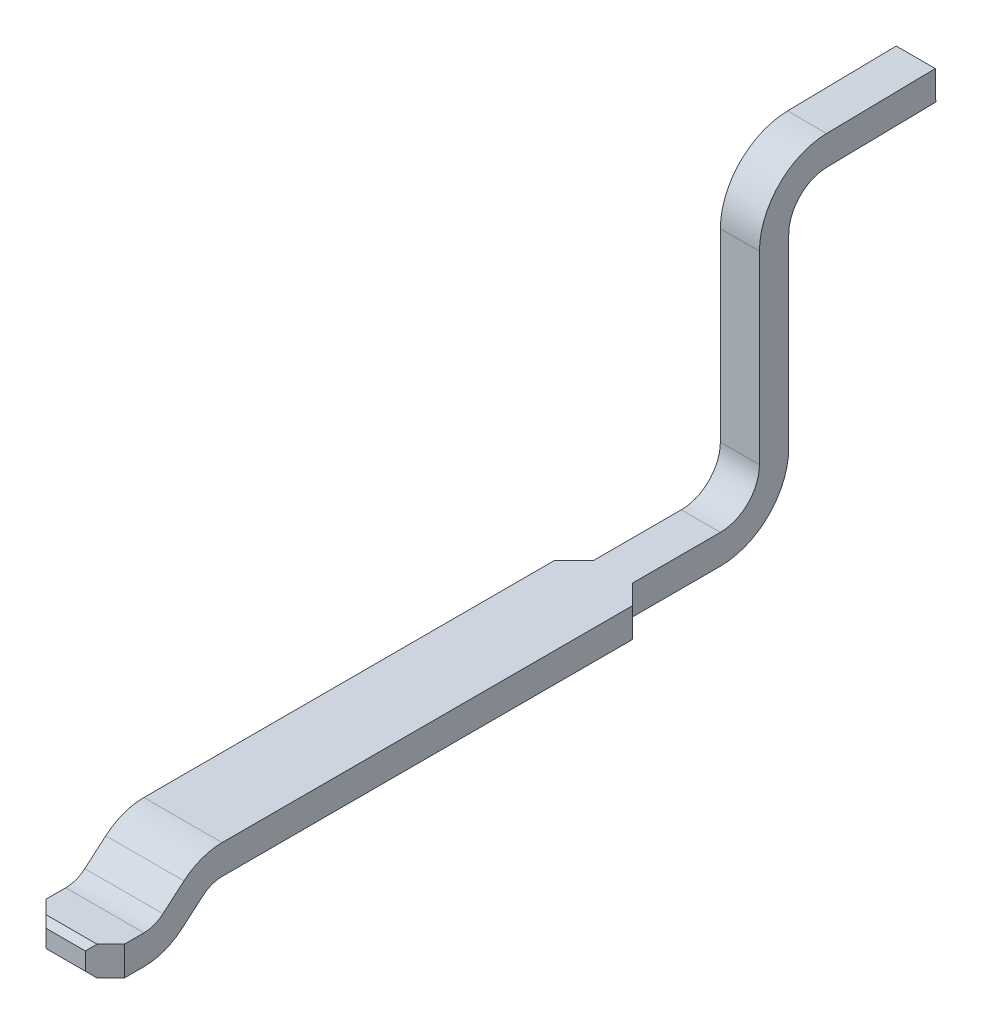
ISO-10303-21;
HEADER;
FILE_DESCRIPTION(('STEP AP214'),'2;1');
FILE_NAME('part.step','',(''),(''),'','','');
FILE_SCHEMA(('AUTOMOTIVE_DESIGN { 1 0 10303 214 1 1 1 1 }'));
ENDSEC;
DATA;
#1=APPLICATION_CONTEXT('core data for automotive mechanical design processes');
#2=APPLICATION_PROTOCOL_DEFINITION('international standard','automotive_design',2000,#1);
#3=PRODUCT_CONTEXT('',#1,'mechanical');
#4=PRODUCT('Part','Part','',(#3));
#5=PRODUCT_RELATED_PRODUCT_CATEGORY('part','',(#4));
#6=PRODUCT_DEFINITION_FORMATION('','',#4);
#7=PRODUCT_DEFINITION_CONTEXT('part definition',#1,'design');
#8=PRODUCT_DEFINITION('design','',#6,#7);
#9=PRODUCT_DEFINITION_SHAPE('','',#8);
#10=(LENGTH_UNIT() NAMED_UNIT(*) SI_UNIT(.MILLI.,.METRE.));
#11=(NAMED_UNIT(*) PLANE_ANGLE_UNIT() SI_UNIT($,.RADIAN.));
#12=(NAMED_UNIT(*) SI_UNIT($,.STERADIAN.) SOLID_ANGLE_UNIT());
#13=UNCERTAINTY_MEASURE_WITH_UNIT(LENGTH_MEASURE(1.E-05),#10,'distance_accuracy_value','');
#14=(GEOMETRIC_REPRESENTATION_CONTEXT(3) GLOBAL_UNCERTAINTY_ASSIGNED_CONTEXT((#13)) GLOBAL_UNIT_ASSIGNED_CONTEXT((#10,
#11,#12)) REPRESENTATION_CONTEXT('',''));
#15=CARTESIAN_POINT('',(0.,0.,0.));
#16=DIRECTION('',(0.,0.,1.));
#17=DIRECTION('',(1.,0.,0.));
#18=AXIS2_PLACEMENT_3D('',#15,#16,#17);
#19=CARTESIAN_POINT('',(1.20403496496787,8.074228109921,4.324047830079));
#20=DIRECTION('',(0.,0.707106781186548,0.707106781186548));
#21=DIRECTION('',(0.,-0.707106781186548,0.707106781186548));
#22=AXIS2_PLACEMENT_3D('',#19,#20,#21);
#23=PLANE('',#22);
#24=DIRECTION('',(-0.577350269189631,0.577350269189615,-0.577350269189631));
#25=VECTOR('',#24,1.);
#26=CARTESIAN_POINT('',(1.23973309999987,8.04019892,4.35807702));
#27=LINE('',#26,#25);
#28=CARTESIAN_POINT('',(1.23973309999987,8.04019892,4.35807702));
#29=VERTEX_POINT('',#28);
#30=CARTESIAN_POINT('',(1.20973309999987,8.07019892,4.32807702));
#31=VERTEX_POINT('',#30);
#32=EDGE_CURVE('E279',#29,#31,#27,.T.);
#33=ORIENTED_EDGE('',*,*,#32,.F.);
#34=DIRECTION('',(-1.,0.,0.));
#35=VECTOR('',#34,1.);
#36=CARTESIAN_POINT('',(1.44543123503187,8.04019892,4.35807702));
#37=LINE('',#36,#35);
#38=CARTESIAN_POINT('',(1.43973309999987,8.04019892,4.35807702));
#39=VERTEX_POINT('',#38);
#40=EDGE_CURVE('E356',#29,#39,#37,.F.);
#41=ORIENTED_EDGE('',*,*,#40,.T.);
#42=DIRECTION('',(-0.577350269189631,-0.577350269189606,0.57735026918964));
#43=VECTOR('',#42,1.);
#44=CARTESIAN_POINT('',(1.46973309999987,8.07019892,4.32807702));
#45=LINE('',#44,#43);
#46=CARTESIAN_POINT('',(1.46973309999987,8.07019892,4.32807702));
#47=VERTEX_POINT('',#46);
#48=EDGE_CURVE('E269',#47,#39,#45,.T.);
#49=ORIENTED_EDGE('',*,*,#48,.F.);
#50=DIRECTION('',(1.,0.,0.));
#51=VECTOR('',#50,1.);
#52=CARTESIAN_POINT('',(1.54773309999987,8.07019892,4.32807702));
#53=LINE('',#52,#51);
#54=EDGE_CURVE('E276',#31,#47,#53,.T.);
#55=ORIENTED_EDGE('',*,*,#54,.F.);
#56=EDGE_LOOP('',(#33,#41,#49,#55));
#57=FACE_BOUND('',#56,.T.);
#58=ADVANCED_FACE('F17',(#57),#23,.T.);
#59=CARTESIAN_POINT('',(1.44543123503187,7.944500784968,4.35807702));
#60=DIRECTION('',(0.,0.,-1.));
#61=DIRECTION('',(-1.,0.,0.));
#62=AXIS2_PLACEMENT_3D('',#59,#60,#61);
#63=PLANE('',#62);
#64=DIRECTION('',(0.,1.,0.));
#65=VECTOR('',#64,1.);
#66=CARTESIAN_POINT('',(1.43973309999987,7.914500784968,4.35807702));
#67=LINE('',#66,#65);
#68=CARTESIAN_POINT('',(1.43973309999987,7.95019892,4.35807702));
#69=VERTEX_POINT('',#68);
#70=EDGE_CURVE('E256',#39,#69,#67,.F.);
#71=ORIENTED_EDGE('',*,*,#70,.F.);
#72=ORIENTED_EDGE('',*,*,#40,.F.);
#73=DIRECTION('',(0.,1.,0.));
#74=VECTOR('',#73,1.);
#75=CARTESIAN_POINT('',(1.23973309999987,7.914500784968,4.35807702));
#76=LINE('',#75,#74);
#77=CARTESIAN_POINT('',(1.23973309999987,7.95019892,4.35807702));
#78=VERTEX_POINT('',#77);
#79=EDGE_CURVE('E338',#78,#29,#76,.T.);
#80=ORIENTED_EDGE('',*,*,#79,.F.);
#81=DIRECTION('',(1.,0.,0.));
#82=VECTOR('',#81,1.);
#83=CARTESIAN_POINT('',(1.47543123503187,7.95019892,4.35807702));
#84=LINE('',#83,#82);
#85=EDGE_CURVE('E331',#69,#78,#84,.F.);
#86=ORIENTED_EDGE('',*,*,#85,.F.);
#87=EDGE_LOOP('',(#71,#72,#80,#86));
#88=FACE_BOUND('',#87,.T.);
#89=ADVANCED_FACE('F775',(#88),#63,.F.);
#90=CARTESIAN_POINT('',(1.47543123503187,7.916169730079,4.324047830079));
#91=DIRECTION('',(0.,-0.707106781186548,0.707106781186548));
#92=DIRECTION('',(0.,-0.707106781186548,-0.707106781186548));
#93=AXIS2_PLACEMENT_3D('',#90,#91,#92);
#94=PLANE('',#93);
#95=DIRECTION('',(0.57735026918962,-0.577350269189629,-0.577350269189629));
#96=VECTOR('',#95,1.);
#97=CARTESIAN_POINT('',(1.43973309999987,7.95019892,4.35807702));
#98=LINE('',#97,#96);
#99=CARTESIAN_POINT('',(1.46973309999987,7.92019892,4.32807702));
#100=VERTEX_POINT('',#99);
#101=EDGE_CURVE('E270',#69,#100,#98,.T.);
#102=ORIENTED_EDGE('',*,*,#101,.F.);
#103=ORIENTED_EDGE('',*,*,#85,.T.);
#104=DIRECTION('',(0.57735026918962,0.577350269189637,0.57735026918962));
#105=VECTOR('',#104,1.);
#106=CARTESIAN_POINT('',(1.20973309999987,7.92019892,4.32807702));
#107=LINE('',#106,#105);
#108=CARTESIAN_POINT('',(1.20973309999987,7.92019892,4.32807702));
#109=VERTEX_POINT('',#108);
#110=EDGE_CURVE('E309',#109,#78,#107,.T.);
#111=ORIENTED_EDGE('',*,*,#110,.F.);
#112=DIRECTION('',(1.,0.,0.));
#113=VECTOR('',#112,1.);
#114=CARTESIAN_POINT('',(1.54773309999987,7.92019892,4.32807702));
#115=LINE('',#114,#113);
#116=EDGE_CURVE('E252',#109,#100,#115,.T.);
#117=ORIENTED_EDGE('',*,*,#116,.T.);
#118=EDGE_LOOP('',(#102,#103,#111,#117));
#119=FACE_BOUND('',#118,.T.);
#120=ADVANCED_FACE('F768',(#119),#94,.T.);
#121=CARTESIAN_POINT('',(1.44543123503187,8.45127780084181,0.758077020000001));
#122=DIRECTION('',(0.,0.,-1.));
#123=DIRECTION('',(-1.,0.,0.));
#124=AXIS2_PLACEMENT_3D('',#121,#122,#123);
#125=PLANE('',#124);
#126=DIRECTION('',(0.,1.,0.));
#127=VECTOR('',#126,1.);
#128=CARTESIAN_POINT('',(1.43973309999987,9.610333059471,0.758077020000001));
#129=LINE('',#128,#127);
#130=CARTESIAN_POINT('',(1.43973309999987,8.47019892,0.758077020000001));
#131=VERTEX_POINT('',#130);
#132=CARTESIAN_POINT('',(1.43973309999987,9.41625487791,0.758077020000001));
#133=VERTEX_POINT('',#132);
#134=EDGE_CURVE('E416',#131,#133,#129,.T.);
#135=ORIENTED_EDGE('',*,*,#134,.F.);
#136=DIRECTION('',(-1.,0.,0.));
#137=VECTOR('',#136,1.);
#138=CARTESIAN_POINT('',(1.43973309999987,8.47019892,0.75807702));
#139=LINE('',#138,#137);
#140=CARTESIAN_POINT('',(1.23973309999987,8.47019892,0.758077020000001));
#141=VERTEX_POINT('',#140);
#142=EDGE_CURVE('E213',#141,#131,#139,.F.);
#143=ORIENTED_EDGE('',*,*,#142,.F.);
#144=DIRECTION('',(0.,1.,0.));
#145=VECTOR('',#144,1.);
#146=CARTESIAN_POINT('',(1.23973309999987,8.45127780084181,0.758077020000001));
#147=LINE('',#146,#145);
#148=CARTESIAN_POINT('',(1.23973309999987,9.41625487791,0.758077020000001));
#149=VERTEX_POINT('',#148);
#150=EDGE_CURVE('E412',#149,#141,#147,.F.);
#151=ORIENTED_EDGE('',*,*,#150,.F.);
#152=DIRECTION('',(1.,0.,0.));
#153=VECTOR('',#152,1.);
#154=CARTESIAN_POINT('',(1.23973309999987,9.41625487791,0.758077020000001));
#155=LINE('',#154,#153);
#156=EDGE_CURVE('E306',#149,#133,#155,.T.);
#157=ORIENTED_EDGE('',*,*,#156,.T.);
#158=EDGE_LOOP('',(#135,#143,#151,#157));
#159=FACE_BOUND('',#158,.T.);
#160=ADVANCED_FACE('F579',(#159),#125,.T.);
#161=CARTESIAN_POINT('',(1.43973309999987,8.47019892,1.10807702));
#162=DIRECTION('',(-1.,0.,0.));
#163=DIRECTION('',(0.,0.,1.));
#164=AXIS2_PLACEMENT_3D('',#161,#162,#163);
#165=CYLINDRICAL_SURFACE('',#164,0.35);
#166=DIRECTION('',(1.,0.,0.));
#167=VECTOR('',#166,1.);
#168=CARTESIAN_POINT('',(1.54773309999987,8.12019892,1.10807702));
#169=LINE('',#168,#167);
#170=CARTESIAN_POINT('',(1.43973309999987,8.12019892,1.10807702));
#171=VERTEX_POINT('',#170);
#172=CARTESIAN_POINT('',(1.23973309999987,8.12019892,1.10807702));
#173=VERTEX_POINT('',#172);
#174=EDGE_CURVE('E229',#171,#173,#169,.F.);
#175=ORIENTED_EDGE('',*,*,#174,.T.);
#176=CARTESIAN_POINT('',(1.23973309999987,8.47019892,1.10807702));
#177=DIRECTION('',(-1.,0.,0.));
#178=DIRECTION('',(0.,0.,1.));
#179=AXIS2_PLACEMENT_3D('',#176,#177,#178);
#180=CIRCLE('',#179,0.35);
#181=EDGE_CURVE('E409',#141,#173,#180,.T.);
#182=ORIENTED_EDGE('',*,*,#181,.F.);
#183=ORIENTED_EDGE('',*,*,#142,.T.);
#184=CARTESIAN_POINT('',(1.43973309999987,8.47019892,1.10807702));
#185=DIRECTION('',(-1.,0.,0.));
#186=DIRECTION('',(0.,0.,1.));
#187=AXIS2_PLACEMENT_3D('',#184,#185,#186);
#188=CIRCLE('',#187,0.35);
#189=EDGE_CURVE('E417',#171,#131,#188,.F.);
#190=ORIENTED_EDGE('',*,*,#189,.F.);
#191=EDGE_LOOP('',(#175,#182,#183,#190));
#192=FACE_BOUND('',#191,.T.);
#193=ADVANCED_FACE('F576',(#192),#165,.T.);
#194=CARTESIAN_POINT('',(1.44543123503187,8.45127780084181,0.908077020000001));
#195=DIRECTION('',(0.,0.,-1.));
#196=DIRECTION('',(-1.,0.,0.));
#197=AXIS2_PLACEMENT_3D('',#194,#195,#196);
#198=PLANE('',#197);
#199=DIRECTION('',(-1.,0.,0.));
#200=VECTOR('',#199,1.);
#201=CARTESIAN_POINT('',(1.43973309999987,8.47019892,0.90807702));
#202=LINE('',#201,#200);
#203=CARTESIAN_POINT('',(1.23973309999987,8.47019892,0.908077020000001));
#204=VERTEX_POINT('',#203);
#205=CARTESIAN_POINT('',(1.43973309999987,8.47019892,0.908077020000001));
#206=VERTEX_POINT('',#205);
#207=EDGE_CURVE('E218',#204,#206,#202,.F.);
#208=ORIENTED_EDGE('',*,*,#207,.T.);
#209=DIRECTION('',(0.,1.,0.));
#210=VECTOR('',#209,1.);
#211=CARTESIAN_POINT('',(1.43973309999987,9.610333059471,0.908077020000001));
#212=LINE('',#211,#210);
#213=CARTESIAN_POINT('',(1.43973309999987,9.41625487791,0.908077020000001));
#214=VERTEX_POINT('',#213);
#215=EDGE_CURVE('E216',#214,#206,#212,.F.);
#216=ORIENTED_EDGE('',*,*,#215,.F.);
#217=DIRECTION('',(1.,0.,0.));
#218=VECTOR('',#217,1.);
#219=CARTESIAN_POINT('',(1.23973309999987,9.41625487791,0.908077020000001));
#220=LINE('',#219,#218);
#221=CARTESIAN_POINT('',(1.23973309999987,9.41625487791,0.908077020000001));
#222=VERTEX_POINT('',#221);
#223=EDGE_CURVE('E203',#222,#214,#220,.T.);
#224=ORIENTED_EDGE('',*,*,#223,.F.);
#225=DIRECTION('',(0.,1.,0.));
#226=VECTOR('',#225,1.);
#227=CARTESIAN_POINT('',(1.23973309999987,8.45127780084181,0.908077020000001));
#228=LINE('',#227,#226);
#229=EDGE_CURVE('E404',#204,#222,#228,.T.);
#230=ORIENTED_EDGE('',*,*,#229,.F.);
#231=EDGE_LOOP('',(#208,#216,#224,#230));
#232=FACE_BOUND('',#231,.T.);
#233=ADVANCED_FACE('F217',(#232),#198,.F.);
#234=CARTESIAN_POINT('',(1.23973309999987,9.41625487791,0.558077020000001));
#235=DIRECTION('',(1.,0.,0.));
#236=DIRECTION('',(0.,0.,-1.));
#237=AXIS2_PLACEMENT_3D('',#234,#235,#236);
#238=CYLINDRICAL_SURFACE('',#237,0.35);
#239=ORIENTED_EDGE('',*,*,#223,.T.);
#240=CARTESIAN_POINT('',(1.43973309999987,9.41625487791,0.558077020000001));
#241=DIRECTION('',(1.,0.,0.));
#242=DIRECTION('',(0.,0.,-1.));
#243=AXIS2_PLACEMENT_3D('',#240,#241,#242);
#244=CIRCLE('',#243,0.35);
#245=CARTESIAN_POINT('',(1.43973309999987,9.76620157121429,0.564185362253241));
#246=VERTEX_POINT('',#245);
#247=EDGE_CURVE('E20',#246,#214,#244,.T.);
#248=ORIENTED_EDGE('',*,*,#247,.F.);
#249=DIRECTION('',(1.,0.,0.));
#250=VECTOR('',#249,1.);
#251=CARTESIAN_POINT('',(1.23403496496787,9.76620157121458,0.564185362253011));
#252=LINE('',#251,#250);
#253=CARTESIAN_POINT('',(1.23973309999987,9.76620157121429,0.564185362253241));
#254=VERTEX_POINT('',#253);
#255=EDGE_CURVE('E198',#254,#246,#252,.T.);
#256=ORIENTED_EDGE('',*,*,#255,.F.);
#257=CARTESIAN_POINT('',(1.23973309999987,9.41625487791,0.558077020000001));
#258=DIRECTION('',(1.,0.,0.));
#259=DIRECTION('',(0.,0.,-1.));
#260=AXIS2_PLACEMENT_3D('',#257,#258,#259);
#261=CIRCLE('',#260,0.35);
#262=EDGE_CURVE('E209',#222,#254,#261,.F.);
#263=ORIENTED_EDGE('',*,*,#262,.F.);
#264=EDGE_LOOP('',(#239,#248,#256,#263));
#265=FACE_BOUND('',#264,.T.);
#266=ADVANCED_FACE('F205',(#265),#238,.T.);
#267=CARTESIAN_POINT('',(1.23403496496787,9.766007480923,0.575304787611001));
#268=DIRECTION('',(0.,0.999847695156406,0.0174524064364471));
#269=DIRECTION('',(0.,-0.0174524064364471,0.999847695156406));
#270=AXIS2_PLACEMENT_3D('',#267,#268,#269);
#271=PLANE('',#270);
#272=DIRECTION('',(0.,0.0174524064385203,-0.99984769515637));
#273=VECTOR('',#272,1.);
#274=CARTESIAN_POINT('',(1.23973309999987,9.766201571214,0.564185362253001));
#275=LINE('',#274,#273);
#276=CARTESIAN_POINT('',(1.23973309999987,9.775906085794,0.00821409435916126));
#277=VERTEX_POINT('',#276);
#278=EDGE_CURVE('E318',#254,#277,#275,.T.);
#279=ORIENTED_EDGE('',*,*,#278,.F.);
#280=ORIENTED_EDGE('',*,*,#255,.T.);
#281=DIRECTION('',(0.,-0.0174524064385203,0.99984769515637));
#282=VECTOR('',#281,1.);
#283=CARTESIAN_POINT('',(1.43973309999987,9.775906085794,0.00821409435900074));
#284=LINE('',#283,#282);
#285=CARTESIAN_POINT('',(1.43973309999987,9.775906085794,0.00821409435916126));
#286=VERTEX_POINT('',#285);
#287=EDGE_CURVE('E226',#286,#246,#284,.T.);
#288=ORIENTED_EDGE('',*,*,#287,.F.);
#289=DIRECTION('',(1.,0.,0.));
#290=VECTOR('',#289,1.);
#291=CARTESIAN_POINT('',(1.44543123503187,9.77590608579399,0.0082140943594823));
#292=LINE('',#291,#290);
#293=EDGE_CURVE('E311',#277,#286,#292,.T.);
#294=ORIENTED_EDGE('',*,*,#293,.F.);
#295=EDGE_LOOP('',(#279,#280,#288,#294));
#296=FACE_BOUND('',#295,.T.);
#297=ADVANCED_FACE('F593',(#296),#271,.T.);
#298=CARTESIAN_POINT('',(1.44543123503187,9.620231664342,0.00549678722500089));
#299=DIRECTION('',(0.,0.0174524064396861,-0.999847695156349));
#300=DIRECTION('',(0.,0.999847695156349,0.0174524064396861));
#301=AXIS2_PLACEMENT_3D('',#298,#299,#300);
#302=PLANE('',#301);
#303=DIRECTION('',(1.,0.,0.));
#304=VECTOR('',#303,1.);
#305=CARTESIAN_POINT('',(1.23403496496787,9.62592893152041,0.00559623339400797));
#306=LINE('',#305,#304);
#307=CARTESIAN_POINT('',(1.43973309999987,9.62592893152018,0.00559623339400417));
#308=VERTEX_POINT('',#307);
#309=CARTESIAN_POINT('',(1.23973309999987,9.62592893152014,0.00559623339400334));
#310=VERTEX_POINT('',#309);
#311=EDGE_CURVE('E307',#308,#310,#306,.F.);
#312=ORIENTED_EDGE('',*,*,#311,.T.);
#313=DIRECTION('',(0.,-0.999847695156461,-0.0174524064332696));
#314=VECTOR('',#313,1.);
#315=CARTESIAN_POINT('',(1.23973309999987,9.775906085794,0.00821409435900074));
#316=LINE('',#315,#314);
#317=EDGE_CURVE('E314',#277,#310,#316,.T.);
#318=ORIENTED_EDGE('',*,*,#317,.F.);
#319=ORIENTED_EDGE('',*,*,#293,.T.);
#320=DIRECTION('',(0.,0.999847695156461,0.0174524064332696));
#321=VECTOR('',#320,1.);
#322=CARTESIAN_POINT('',(1.43973309999987,9.62592893152,0.00559623339400103));
#323=LINE('',#322,#321);
#324=EDGE_CURVE('E328',#308,#286,#323,.T.);
#325=ORIENTED_EDGE('',*,*,#324,.F.);
#326=EDGE_LOOP('',(#312,#318,#319,#325));
#327=FACE_BOUND('',#326,.T.);
#328=ADVANCED_FACE('F592',(#327),#302,.T.);
#329=CARTESIAN_POINT('',(1.23403496496787,9.616030326649,0.572686926645001));
#330=DIRECTION('',(0.,0.999847695156375,0.0174524064382066));
#331=DIRECTION('',(0.,-0.0174524064382066,0.999847695156375));
#332=AXIS2_PLACEMENT_3D('',#329,#330,#331);
#333=PLANE('',#332);
#334=DIRECTION('',(1.,0.,0.));
#335=VECTOR('',#334,1.);
#336=CARTESIAN_POINT('',(1.23973309999987,9.61622441694128,0.561567501287006));
#337=LINE('',#336,#335);
#338=CARTESIAN_POINT('',(1.43973309999987,9.61622441694114,0.561567501287176));
#339=VERTEX_POINT('',#338);
#340=CARTESIAN_POINT('',(1.23973309999987,9.61622441694114,0.561567501287176));
#341=VERTEX_POINT('',#340);
#342=EDGE_CURVE('E304',#339,#341,#337,.F.);
#343=ORIENTED_EDGE('',*,*,#342,.T.);
#344=DIRECTION('',(0.,-0.0174524064367521,0.999847695156401));
#345=VECTOR('',#344,1.);
#346=CARTESIAN_POINT('',(1.23973309999987,9.62592893152,0.00559623339400103));
#347=LINE('',#346,#345);
#348=EDGE_CURVE('E317',#310,#341,#347,.T.);
#349=ORIENTED_EDGE('',*,*,#348,.F.);
#350=ORIENTED_EDGE('',*,*,#311,.F.);
#351=DIRECTION('',(0.,0.0174524064367521,-0.999847695156401));
#352=VECTOR('',#351,1.);
#353=CARTESIAN_POINT('',(1.43973309999987,9.616224416941,0.561567501287001));
#354=LINE('',#353,#352);
#355=EDGE_CURVE('E333',#339,#308,#354,.T.);
#356=ORIENTED_EDGE('',*,*,#355,.F.);
#357=EDGE_LOOP('',(#343,#349,#350,#356));
#358=FACE_BOUND('',#357,.T.);
#359=ADVANCED_FACE('F588',(#358),#333,.F.);
#360=CARTESIAN_POINT('',(1.23973309999987,9.41625487791,0.558077020000001));
#361=DIRECTION('',(1.,0.,0.));
#362=DIRECTION('',(0.,0.,-1.));
#363=AXIS2_PLACEMENT_3D('',#360,#361,#362);
#364=CYLINDRICAL_SURFACE('',#363,0.2);
#365=ORIENTED_EDGE('',*,*,#156,.F.);
#366=CARTESIAN_POINT('',(1.23973309999987,9.41625487791,0.558077020000001));
#367=DIRECTION('',(1.,0.,0.));
#368=DIRECTION('',(0.,0.,-1.));
#369=AXIS2_PLACEMENT_3D('',#366,#367,#368);
#370=CIRCLE('',#369,0.2);
#371=EDGE_CURVE('E400',#341,#149,#370,.T.);
#372=ORIENTED_EDGE('',*,*,#371,.F.);
#373=ORIENTED_EDGE('',*,*,#342,.F.);
#374=CARTESIAN_POINT('',(1.43973309999987,9.41625487791,0.558077020000001));
#375=DIRECTION('',(1.,0.,0.));
#376=DIRECTION('',(0.,0.,-1.));
#377=AXIS2_PLACEMENT_3D('',#374,#375,#376);
#378=CIRCLE('',#377,0.2);
#379=EDGE_CURVE('E414',#133,#339,#378,.F.);
#380=ORIENTED_EDGE('',*,*,#379,.F.);
#381=EDGE_LOOP('',(#365,#372,#373,#380));
#382=FACE_BOUND('',#381,.T.);
#383=ADVANCED_FACE('F584',(#382),#364,.F.);
#384=CARTESIAN_POINT('',(1.13570391007887,7.914500784968,4.254047830079));
#385=DIRECTION('',(-0.707106781186548,0.,0.707106781186548));
#386=DIRECTION('',(0.707106781186548,0.,0.707106781186548));
#387=AXIS2_PLACEMENT_3D('',#384,#385,#386);
#388=PLANE('',#387);
#389=DIRECTION('',(0.,1.,0.));
#390=VECTOR('',#389,1.);
#391=CARTESIAN_POINT('',(1.13973309999987,7.914500784968,4.25807702));
#392=LINE('',#391,#390);
#393=CARTESIAN_POINT('',(1.13973309999987,8.07019892,4.25807702));
#394=VERTEX_POINT('',#393);
#395=CARTESIAN_POINT('',(1.13973309999987,7.92019892,4.25807702));
#396=VERTEX_POINT('',#395);
#397=EDGE_CURVE('E295',#394,#396,#392,.F.);
#398=ORIENTED_EDGE('',*,*,#397,.T.);
#399=DIRECTION('',(0.707106781186544,0.,0.707106781186551));
#400=VECTOR('',#399,1.);
#401=CARTESIAN_POINT('',(1.13973309999987,7.92019892,4.25807702));
#402=LINE('',#401,#400);
#403=EDGE_CURVE('E255',#396,#109,#402,.T.);
#404=ORIENTED_EDGE('',*,*,#403,.T.);
#405=ORIENTED_EDGE('',*,*,#110,.T.);
#406=ORIENTED_EDGE('',*,*,#79,.T.);
#407=ORIENTED_EDGE('',*,*,#32,.T.);
#408=DIRECTION('',(0.707106781186544,0.,0.707106781186551));
#409=VECTOR('',#408,1.);
#410=CARTESIAN_POINT('',(1.13973309999987,8.07019892,4.25807702));
#411=LINE('',#410,#409);
#412=EDGE_CURVE('E275',#394,#31,#411,.T.);
#413=ORIENTED_EDGE('',*,*,#412,.F.);
#414=EDGE_LOOP('',(#398,#404,#405,#406,#407,#413));
#415=FACE_BOUND('',#414,.T.);
#416=ADVANCED_FACE('F712',(#415),#388,.T.);
#417=CARTESIAN_POINT('',(1.54773309999987,8.102515836027,4.064893542443));
#418=DIRECTION('',(0.,0.759858617954068,0.650088363779058));
#419=DIRECTION('',(0.,-0.650088363779058,0.759858617954068));
#420=AXIS2_PLACEMENT_3D('',#417,#418,#419);
#421=PLANE('',#420);
#422=DIRECTION('',(0.,-0.650088363774947,0.759858617957586));
#423=VECTOR('',#422,1.);
#424=CARTESIAN_POINT('',(1.13973309999987,8.198156505386,3.953103529133));
#425=LINE('',#424,#423);
#426=CARTESIAN_POINT('',(1.13973309999987,8.19815650538664,3.95310352913274));
#427=VERTEX_POINT('',#426);
#428=CARTESIAN_POINT('',(1.13973309999987,8.10622012730668,4.06056376543338));
#429=VERTEX_POINT('',#428);
#430=EDGE_CURVE('E393',#427,#429,#425,.T.);
#431=ORIENTED_EDGE('',*,*,#430,.T.);
#432=DIRECTION('',(-1.,0.,0.));
#433=VECTOR('',#432,1.);
#434=CARTESIAN_POINT('',(1.53973309999987,8.10622012730701,4.06056376543301));
#435=LINE('',#434,#433);
#436=CARTESIAN_POINT('',(1.53973309999987,8.10622012730668,4.06056376543338));
#437=VERTEX_POINT('',#436);
#438=EDGE_CURVE('E277',#429,#437,#435,.F.);
#439=ORIENTED_EDGE('',*,*,#438,.T.);
#440=DIRECTION('',(0.,-0.650088363774947,0.759858617957586));
#441=VECTOR('',#440,1.);
#442=CARTESIAN_POINT('',(1.53973309999987,8.198156505386,3.953103529133));
#443=LINE('',#442,#441);
#444=CARTESIAN_POINT('',(1.53973309999987,8.19815650538664,3.95310352913274));
#445=VERTEX_POINT('',#444);
#446=EDGE_CURVE('E385',#445,#437,#443,.T.);
#447=ORIENTED_EDGE('',*,*,#446,.F.);
#448=DIRECTION('',(-1.,0.,0.));
#449=VECTOR('',#448,1.);
#450=CARTESIAN_POINT('',(1.53973309999987,8.19815650538648,3.95310352913341));
#451=LINE('',#450,#449);
#452=EDGE_CURVE('E280',#427,#445,#451,.F.);
#453=ORIENTED_EDGE('',*,*,#452,.F.);
#454=EDGE_LOOP('',(#431,#439,#447,#453));
#455=FACE_BOUND('',#454,.T.);
#456=ADVANCED_FACE('F528',(#455),#421,.T.);
#457=CARTESIAN_POINT('',(1.53973309999987,8.22019892,4.15807702));
#458=DIRECTION('',(-1.,0.,0.));
#459=DIRECTION('',(0.,0.,1.));
#460=AXIS2_PLACEMENT_3D('',#457,#458,#459);
#461=CYLINDRICAL_SURFACE('',#460,0.15);
#462=CARTESIAN_POINT('',(1.13973309999987,8.22019892,4.15807702));
#463=DIRECTION('',(-1.,0.,0.));
#464=DIRECTION('',(0.,0.,1.));
#465=AXIS2_PLACEMENT_3D('',#462,#463,#464);
#466=CIRCLE('',#465,0.15);
#467=CARTESIAN_POINT('',(1.13973309999987,8.07019892,4.15807702));
#468=VERTEX_POINT('',#467);
#469=EDGE_CURVE('E390',#429,#468,#466,.T.);
#470=ORIENTED_EDGE('',*,*,#469,.T.);
#471=DIRECTION('',(1.,0.,0.));
#472=VECTOR('',#471,1.);
#473=CARTESIAN_POINT('',(1.54773309999987,8.07019892,4.15807702));
#474=LINE('',#473,#472);
#475=CARTESIAN_POINT('',(1.53973309999987,8.07019892,4.15807702));
#476=VERTEX_POINT('',#475);
#477=EDGE_CURVE('E273',#476,#468,#474,.F.);
#478=ORIENTED_EDGE('',*,*,#477,.F.);
#479=CARTESIAN_POINT('',(1.53973309999987,8.22019892,4.15807702));
#480=DIRECTION('',(-1.,0.,0.));
#481=DIRECTION('',(0.,0.,1.));
#482=AXIS2_PLACEMENT_3D('',#479,#480,#481);
#483=CIRCLE('',#482,0.15);
#484=EDGE_CURVE('E382',#437,#476,#483,.T.);
#485=ORIENTED_EDGE('',*,*,#484,.F.);
#486=ORIENTED_EDGE('',*,*,#438,.F.);
#487=EDGE_LOOP('',(#470,#478,#485,#486));
#488=FACE_BOUND('',#487,.T.);
#489=ADVANCED_FACE('F533',(#488),#461,.F.);
#490=CARTESIAN_POINT('',(1.54773309999987,8.07019892,4.333775155032));
#491=DIRECTION('',(0.,1.,0.));
#492=DIRECTION('',(0.,0.,1.));
#493=AXIS2_PLACEMENT_3D('',#490,#491,#492);
#494=PLANE('',#493);
#495=DIRECTION('',(0.,0.,-1.));
#496=VECTOR('',#495,1.);
#497=CARTESIAN_POINT('',(1.13973309999987,8.07019892,4.163775155032));
#498=LINE('',#497,#496);
#499=EDGE_CURVE('E287',#468,#394,#498,.F.);
#500=ORIENTED_EDGE('',*,*,#499,.T.);
#501=ORIENTED_EDGE('',*,*,#412,.T.);
#502=ORIENTED_EDGE('',*,*,#54,.T.);
#503=DIRECTION('',(0.707106781186548,0.,-0.707106781186548));
#504=VECTOR('',#503,1.);
#505=CARTESIAN_POINT('',(1.43570391007887,8.07019892,4.362106209921));
#506=LINE('',#505,#504);
#507=CARTESIAN_POINT('',(1.53973309999987,8.07019892,4.25807702));
#508=VERTEX_POINT('',#507);
#509=EDGE_CURVE('E266',#508,#47,#506,.F.);
#510=ORIENTED_EDGE('',*,*,#509,.F.);
#511=DIRECTION('',(0.,0.,-1.));
#512=VECTOR('',#511,1.);
#513=CARTESIAN_POINT('',(1.53973309999987,8.07019892,3.80007702));
#514=LINE('',#513,#512);
#515=EDGE_CURVE('E263',#476,#508,#514,.F.);
#516=ORIENTED_EDGE('',*,*,#515,.F.);
#517=ORIENTED_EDGE('',*,*,#477,.T.);
#518=EDGE_LOOP('',(#500,#501,#502,#510,#516,#517));
#519=FACE_BOUND('',#518,.T.);
#520=ADVANCED_FACE('F537',(#519),#494,.T.);
#521=CARTESIAN_POINT('',(1.43570391007887,7.914500784968,4.362106209921));
#522=DIRECTION('',(0.707106781186548,0.,0.707106781186548));
#523=DIRECTION('',(0.707106781186548,0.,-0.707106781186548));
#524=AXIS2_PLACEMENT_3D('',#521,#522,#523);
#525=PLANE('',#524);
#526=ORIENTED_EDGE('',*,*,#48,.T.);
#527=ORIENTED_EDGE('',*,*,#70,.T.);
#528=ORIENTED_EDGE('',*,*,#101,.T.);
#529=DIRECTION('',(0.707106781186545,0.,-0.70710678118655));
#530=VECTOR('',#529,1.);
#531=CARTESIAN_POINT('',(1.46973309999987,7.92019892,4.32807702));
#532=LINE('',#531,#530);
#533=CARTESIAN_POINT('',(1.53973309999987,7.92019892,4.25807702));
#534=VERTEX_POINT('',#533);
#535=EDGE_CURVE('E253',#100,#534,#532,.T.);
#536=ORIENTED_EDGE('',*,*,#535,.T.);
#537=DIRECTION('',(0.,1.,0.));
#538=VECTOR('',#537,1.);
#539=CARTESIAN_POINT('',(1.53973309999987,8.114500784968,4.25807702));
#540=LINE('',#539,#538);
#541=EDGE_CURVE('E259',#508,#534,#540,.F.);
#542=ORIENTED_EDGE('',*,*,#541,.F.);
#543=ORIENTED_EDGE('',*,*,#509,.T.);
#544=EDGE_LOOP('',(#526,#527,#528,#536,#542,#543));
#545=FACE_BOUND('',#544,.T.);
#546=ADVANCED_FACE('F540',(#545),#525,.T.);
#547=CARTESIAN_POINT('',(1.54773309999987,7.92019892,4.333775155032));
#548=DIRECTION('',(0.,1.,0.));
#549=DIRECTION('',(0.,0.,1.));
#550=AXIS2_PLACEMENT_3D('',#547,#548,#549);
#551=PLANE('',#550);
#552=ORIENTED_EDGE('',*,*,#403,.F.);
#553=DIRECTION('',(0.,0.,-1.));
#554=VECTOR('',#553,1.);
#555=CARTESIAN_POINT('',(1.13973309999987,7.92019892,4.163775155032));
#556=LINE('',#555,#554);
#557=CARTESIAN_POINT('',(1.13973309999987,7.92019892,4.15807702));
#558=VERTEX_POINT('',#557);
#559=EDGE_CURVE('E297',#396,#558,#556,.T.);
#560=ORIENTED_EDGE('',*,*,#559,.T.);
#561=DIRECTION('',(-1.,0.,0.));
#562=VECTOR('',#561,1.);
#563=CARTESIAN_POINT('',(1.53973309999987,7.92019892,4.15807702));
#564=LINE('',#563,#562);
#565=CARTESIAN_POINT('',(1.53973309999987,7.92019892,4.15807702));
#566=VERTEX_POINT('',#565);
#567=EDGE_CURVE('E249',#566,#558,#564,.T.);
#568=ORIENTED_EDGE('',*,*,#567,.F.);
#569=DIRECTION('',(0.,0.,-1.));
#570=VECTOR('',#569,1.);
#571=CARTESIAN_POINT('',(1.53973309999987,7.92019892,3.80007702));
#572=LINE('',#571,#570);
#573=EDGE_CURVE('E262',#534,#566,#572,.T.);
#574=ORIENTED_EDGE('',*,*,#573,.F.);
#575=ORIENTED_EDGE('',*,*,#535,.F.);
#576=ORIENTED_EDGE('',*,*,#116,.F.);
#577=EDGE_LOOP('',(#552,#560,#568,#574,#575,#576));
#578=FACE_BOUND('',#577,.T.);
#579=ADVANCED_FACE('F547',(#578),#551,.F.);
#580=CARTESIAN_POINT('',(1.53973309999987,8.22019892,4.15807702));
#581=DIRECTION('',(-1.,0.,0.));
#582=DIRECTION('',(0.,0.,1.));
#583=AXIS2_PLACEMENT_3D('',#580,#581,#582);
#584=CYLINDRICAL_SURFACE('',#583,0.3);
#585=CARTESIAN_POINT('',(1.13973309999987,8.22019892,4.15807702));
#586=DIRECTION('',(-1.,0.,0.));
#587=DIRECTION('',(0.,0.,1.));
#588=AXIS2_PLACEMENT_3D('',#585,#586,#587);
#589=CIRCLE('',#588,0.3);
#590=CARTESIAN_POINT('',(1.13973309999987,7.99224133461339,3.96305051086728));
#591=VERTEX_POINT('',#590);
#592=EDGE_CURVE('E398',#558,#591,#589,.F.);
#593=ORIENTED_EDGE('',*,*,#592,.T.);
#594=DIRECTION('',(1.,0.,0.));
#595=VECTOR('',#594,1.);
#596=CARTESIAN_POINT('',(1.54773309999987,7.99224133461357,3.96305051086664));
#597=LINE('',#596,#595);
#598=CARTESIAN_POINT('',(1.53973309999987,7.99224133461339,3.96305051086728));
#599=VERTEX_POINT('',#598);
#600=EDGE_CURVE('E247',#591,#599,#597,.T.);
#601=ORIENTED_EDGE('',*,*,#600,.T.);
#602=CARTESIAN_POINT('',(1.53973309999987,8.22019892,4.15807702));
#603=DIRECTION('',(-1.,0.,0.));
#604=DIRECTION('',(0.,0.,1.));
#605=AXIS2_PLACEMENT_3D('',#602,#603,#604);
#606=CIRCLE('',#605,0.3);
#607=EDGE_CURVE('E379',#566,#599,#606,.F.);
#608=ORIENTED_EDGE('',*,*,#607,.F.);
#609=ORIENTED_EDGE('',*,*,#567,.T.);
#610=EDGE_LOOP('',(#593,#601,#608,#609));
#611=FACE_BOUND('',#610,.T.);
#612=ADVANCED_FACE('F551',(#611),#584,.T.);
#613=CARTESIAN_POINT('',(1.54773309999987,7.988537043334,3.967380287877));
#614=DIRECTION('',(0.,0.759858617954068,0.650088363779058));
#615=DIRECTION('',(0.,-0.650088363779058,0.759858617954068));
#616=AXIS2_PLACEMENT_3D('',#613,#614,#615);
#617=PLANE('',#616);
#618=ORIENTED_EDGE('',*,*,#600,.F.);
#619=DIRECTION('',(0.,0.650088363774937,-0.759858617957595));
#620=VECTOR('',#619,1.);
#621=CARTESIAN_POINT('',(1.13973309999987,7.992241334614,3.963050510867));
#622=LINE('',#621,#620);
#623=CARTESIAN_POINT('',(1.13973309999987,8.08417771269332,3.85559027456662));
#624=VERTEX_POINT('',#623);
#625=EDGE_CURVE('E397',#591,#624,#622,.T.);
#626=ORIENTED_EDGE('',*,*,#625,.T.);
#627=DIRECTION('',(-1.,0.,0.));
#628=VECTOR('',#627,1.);
#629=CARTESIAN_POINT('',(1.53973309999987,8.08417771269299,3.85559027456699));
#630=LINE('',#629,#628);
#631=CARTESIAN_POINT('',(1.53973309999987,8.08417771269332,3.85559027456662));
#632=VERTEX_POINT('',#631);
#633=EDGE_CURVE('E243',#624,#632,#630,.F.);
#634=ORIENTED_EDGE('',*,*,#633,.T.);
#635=DIRECTION('',(0.,0.650088363774937,-0.759858617957595));
#636=VECTOR('',#635,1.);
#637=CARTESIAN_POINT('',(1.53973309999987,7.992241334614,3.963050510867));
#638=LINE('',#637,#636);
#639=EDGE_CURVE('E378',#599,#632,#638,.T.);
#640=ORIENTED_EDGE('',*,*,#639,.F.);
#641=EDGE_LOOP('',(#618,#626,#634,#640));
#642=FACE_BOUND('',#641,.T.);
#643=ADVANCED_FACE('F556',(#642),#617,.F.);
#644=CARTESIAN_POINT('',(1.53973309999987,7.97019892,3.75807702));
#645=DIRECTION('',(-1.,0.,0.));
#646=DIRECTION('',(0.,0.,1.));
#647=AXIS2_PLACEMENT_3D('',#644,#645,#646);
#648=CYLINDRICAL_SURFACE('',#647,0.15);
#649=CARTESIAN_POINT('',(1.13973309999987,7.97019892,3.75807702));
#650=DIRECTION('',(-1.,0.,0.));
#651=DIRECTION('',(0.,0.,1.));
#652=AXIS2_PLACEMENT_3D('',#649,#650,#651);
#653=CIRCLE('',#652,0.15);
#654=CARTESIAN_POINT('',(1.13973309999987,8.12019892,3.75807702));
#655=VERTEX_POINT('',#654);
#656=EDGE_CURVE('E394',#624,#655,#653,.T.);
#657=ORIENTED_EDGE('',*,*,#656,.T.);
#658=DIRECTION('',(1.,0.,0.));
#659=VECTOR('',#658,1.);
#660=CARTESIAN_POINT('',(1.54773309999987,8.12019892,3.75807702));
#661=LINE('',#660,#659);
#662=CARTESIAN_POINT('',(1.53973309999987,8.12019892,3.75807702));
#663=VERTEX_POINT('',#662);
#664=EDGE_CURVE('E227',#655,#663,#661,.T.);
#665=ORIENTED_EDGE('',*,*,#664,.T.);
#666=CARTESIAN_POINT('',(1.53973309999987,7.97019892,3.75807702));
#667=DIRECTION('',(-1.,0.,0.));
#668=DIRECTION('',(0.,0.,1.));
#669=AXIS2_PLACEMENT_3D('',#666,#667,#668);
#670=CIRCLE('',#669,0.15);
#671=EDGE_CURVE('E374',#632,#663,#670,.T.);
#672=ORIENTED_EDGE('',*,*,#671,.F.);
#673=ORIENTED_EDGE('',*,*,#633,.F.);
#674=EDGE_LOOP('',(#657,#665,#672,#673));
#675=FACE_BOUND('',#674,.T.);
#676=ADVANCED_FACE('F560',(#675),#648,.F.);
#677=CARTESIAN_POINT('',(1.54773309999987,8.12019892,3.81107702));
#678=DIRECTION('',(0.,1.,0.));
#679=DIRECTION('',(0.,0.,1.));
#680=AXIS2_PLACEMENT_3D('',#677,#678,#679);
#681=PLANE('',#680);
#682=ORIENTED_EDGE('',*,*,#664,.F.);
#683=DIRECTION('',(0.,0.,-1.));
#684=VECTOR('',#683,1.);
#685=CARTESIAN_POINT('',(1.13973309999987,8.12019892,4.163775155032));
#686=LINE('',#685,#684);
#687=CARTESIAN_POINT('',(1.13973309999987,8.12019892,1.65807702));
#688=VERTEX_POINT('',#687);
#689=EDGE_CURVE('E396',#655,#688,#686,.T.);
#690=ORIENTED_EDGE('',*,*,#689,.T.);
#691=DIRECTION('',(-0.707106781186548,0.,0.707106781186548));
#692=VECTOR('',#691,1.);
#693=CARTESIAN_POINT('',(1.13570391007887,8.12019892,1.662106209921));
#694=LINE('',#693,#692);
#695=CARTESIAN_POINT('',(1.23973309999987,8.12019892,1.55807702));
#696=VERTEX_POINT('',#695);
#697=EDGE_CURVE('E284',#696,#688,#694,.T.);
#698=ORIENTED_EDGE('',*,*,#697,.F.);
#699=DIRECTION('',(0.,0.,1.));
#700=VECTOR('',#699,1.);
#701=CARTESIAN_POINT('',(1.23973309999987,8.12019892,0.913775155032));
#702=LINE('',#701,#700);
#703=EDGE_CURVE('E408',#173,#696,#702,.T.);
#704=ORIENTED_EDGE('',*,*,#703,.F.);
#705=ORIENTED_EDGE('',*,*,#174,.F.);
#706=DIRECTION('',(0.,0.,-1.));
#707=VECTOR('',#706,1.);
#708=CARTESIAN_POINT('',(1.43973309999987,8.12019892,0.572587480477));
#709=LINE('',#708,#707);
#710=CARTESIAN_POINT('',(1.43973309999987,8.12019892,1.55807702));
#711=VERTEX_POINT('',#710);
#712=EDGE_CURVE('E221',#711,#171,#709,.T.);
#713=ORIENTED_EDGE('',*,*,#712,.F.);
#714=DIRECTION('',(-0.707106781186548,0.,-0.707106781186547));
#715=VECTOR('',#714,1.);
#716=CARTESIAN_POINT('',(1.53973309999987,8.12019892,1.65807702));
#717=LINE('',#716,#715);
#718=CARTESIAN_POINT('',(1.53973309999987,8.12019892,1.65807702));
#719=VERTEX_POINT('',#718);
#720=EDGE_CURVE('E241',#719,#711,#717,.T.);
#721=ORIENTED_EDGE('',*,*,#720,.F.);
#722=DIRECTION('',(0.,0.,-1.));
#723=VECTOR('',#722,1.);
#724=CARTESIAN_POINT('',(1.53973309999987,8.12019892,3.80007702));
#725=LINE('',#724,#723);
#726=EDGE_CURVE('E377',#663,#719,#725,.T.);
#727=ORIENTED_EDGE('',*,*,#726,.F.);
#728=EDGE_LOOP('',(#682,#690,#698,#704,#705,#713,#721,#727));
#729=FACE_BOUND('',#728,.T.);
#730=ADVANCED_FACE('F562',(#729),#681,.F.);
#731=CARTESIAN_POINT('',(1.43973309999987,9.610333059471,0.572587480477));
#732=DIRECTION('',(1.,0.,0.));
#733=DIRECTION('',(0.,0.,-1.));
#734=AXIS2_PLACEMENT_3D('',#731,#732,#733);
#735=PLANE('',#734);
#736=ORIENTED_EDGE('',*,*,#355,.T.);
#737=ORIENTED_EDGE('',*,*,#324,.T.);
#738=ORIENTED_EDGE('',*,*,#287,.T.);
#739=ORIENTED_EDGE('',*,*,#247,.T.);
#740=ORIENTED_EDGE('',*,*,#215,.T.);
#741=CARTESIAN_POINT('',(1.43973309999987,8.47019892,1.10807702));
#742=DIRECTION('',(-1.,0.,0.));
#743=DIRECTION('',(0.,0.,1.));
#744=AXIS2_PLACEMENT_3D('',#741,#742,#743);
#745=CIRCLE('',#744,0.2);
#746=CARTESIAN_POINT('',(1.43973309999987,8.27019892,1.10807702));
#747=VERTEX_POINT('',#746);
#748=EDGE_CURVE('E327',#206,#747,#745,.T.);
#749=ORIENTED_EDGE('',*,*,#748,.T.);
#750=DIRECTION('',(0.,0.,1.));
#751=VECTOR('',#750,1.);
#752=CARTESIAN_POINT('',(1.43973309999987,8.27019892,3.81107702));
#753=LINE('',#752,#751);
#754=CARTESIAN_POINT('',(1.43973309999987,8.27019892,1.55807702));
#755=VERTEX_POINT('',#754);
#756=EDGE_CURVE('E238',#755,#747,#753,.F.);
#757=ORIENTED_EDGE('',*,*,#756,.F.);
#758=DIRECTION('',(0.,1.,0.));
#759=VECTOR('',#758,1.);
#760=CARTESIAN_POINT('',(1.43973309999987,8.275897055032,1.55807702));
#761=LINE('',#760,#759);
#762=EDGE_CURVE('E235',#711,#755,#761,.T.);
#763=ORIENTED_EDGE('',*,*,#762,.F.);
#764=ORIENTED_EDGE('',*,*,#712,.T.);
#765=ORIENTED_EDGE('',*,*,#189,.T.);
#766=ORIENTED_EDGE('',*,*,#134,.T.);
#767=ORIENTED_EDGE('',*,*,#379,.T.);
#768=EDGE_LOOP('',(#736,#737,#738,#739,#740,#749,#757,#763,#764,#765,#766,#767));
#769=FACE_BOUND('',#768,.T.);
#770=ADVANCED_FACE('F224',(#769),#735,.T.);
#771=CARTESIAN_POINT('',(1.43973309999987,8.47019892,1.10807702));
#772=DIRECTION('',(-1.,0.,0.));
#773=DIRECTION('',(0.,0.,1.));
#774=AXIS2_PLACEMENT_3D('',#771,#772,#773);
#775=CYLINDRICAL_SURFACE('',#774,0.2);
#776=DIRECTION('',(1.,0.,0.));
#777=VECTOR('',#776,1.);
#778=CARTESIAN_POINT('',(1.54773309999987,8.27019892,1.10807702));
#779=LINE('',#778,#777);
#780=CARTESIAN_POINT('',(1.23973309999987,8.27019892,1.10807702));
#781=VERTEX_POINT('',#780);
#782=EDGE_CURVE('E435',#747,#781,#779,.F.);
#783=ORIENTED_EDGE('',*,*,#782,.F.);
#784=ORIENTED_EDGE('',*,*,#748,.F.);
#785=ORIENTED_EDGE('',*,*,#207,.F.);
#786=CARTESIAN_POINT('',(1.23973309999987,8.47019892,1.10807702));
#787=DIRECTION('',(-1.,0.,0.));
#788=DIRECTION('',(0.,0.,1.));
#789=AXIS2_PLACEMENT_3D('',#786,#787,#788);
#790=CIRCLE('',#789,0.2);
#791=EDGE_CURVE('E405',#781,#204,#790,.F.);
#792=ORIENTED_EDGE('',*,*,#791,.F.);
#793=EDGE_LOOP('',(#783,#784,#785,#792));
#794=FACE_BOUND('',#793,.T.);
#795=ADVANCED_FACE('F597',(#794),#775,.F.);
#796=CARTESIAN_POINT('',(1.23973309999987,8.45127780084181,0.913775155032));
#797=DIRECTION('',(-1.,0.,0.));
#798=DIRECTION('',(0.,0.,1.));
#799=AXIS2_PLACEMENT_3D('',#796,#797,#798);
#800=PLANE('',#799);
#801=ORIENTED_EDGE('',*,*,#348,.T.);
#802=ORIENTED_EDGE('',*,*,#371,.T.);
#803=ORIENTED_EDGE('',*,*,#150,.T.);
#804=ORIENTED_EDGE('',*,*,#181,.T.);
#805=ORIENTED_EDGE('',*,*,#703,.T.);
#806=DIRECTION('',(0.,1.,0.));
#807=VECTOR('',#806,1.);
#808=CARTESIAN_POINT('',(1.23973309999987,8.275897055032,1.55807702));
#809=LINE('',#808,#807);
#810=CARTESIAN_POINT('',(1.23973309999987,8.27019892,1.55807702));
#811=VERTEX_POINT('',#810);
#812=EDGE_CURVE('E288',#811,#696,#809,.F.);
#813=ORIENTED_EDGE('',*,*,#812,.F.);
#814=DIRECTION('',(0.,0.,1.));
#815=VECTOR('',#814,1.);
#816=CARTESIAN_POINT('',(1.23973309999987,8.27019892,3.81107702));
#817=LINE('',#816,#815);
#818=EDGE_CURVE('E438',#781,#811,#817,.T.);
#819=ORIENTED_EDGE('',*,*,#818,.F.);
#820=ORIENTED_EDGE('',*,*,#791,.T.);
#821=ORIENTED_EDGE('',*,*,#229,.T.);
#822=ORIENTED_EDGE('',*,*,#262,.T.);
#823=ORIENTED_EDGE('',*,*,#278,.T.);
#824=ORIENTED_EDGE('',*,*,#317,.T.);
#825=EDGE_LOOP('',(#801,#802,#803,#804,#805,#813,#819,#820,#821,#822,#823,#824));
#826=FACE_BOUND('',#825,.T.);
#827=ADVANCED_FACE('F574',(#826),#800,.T.);
#828=CARTESIAN_POINT('',(1.13570391007887,8.275897055032,1.662106209921));
#829=DIRECTION('',(-0.707106781186548,0.,-0.707106781186548));
#830=DIRECTION('',(-0.707106781186548,0.,0.707106781186548));
#831=AXIS2_PLACEMENT_3D('',#828,#829,#830);
#832=PLANE('',#831);
#833=DIRECTION('',(0.,1.,0.));
#834=VECTOR('',#833,1.);
#835=CARTESIAN_POINT('',(1.13973309999987,7.914500784968,1.65807702));
#836=LINE('',#835,#834);
#837=CARTESIAN_POINT('',(1.13973309999987,8.27019892,1.65807702));
#838=VERTEX_POINT('',#837);
#839=EDGE_CURVE('E469',#688,#838,#836,.T.);
#840=ORIENTED_EDGE('',*,*,#839,.T.);
#841=DIRECTION('',(-0.707106781186547,0.,0.707106781186547));
#842=VECTOR('',#841,1.);
#843=CARTESIAN_POINT('',(1.23973309999987,8.27019892,1.55807702));
#844=LINE('',#843,#842);
#845=EDGE_CURVE('E457',#811,#838,#844,.T.);
#846=ORIENTED_EDGE('',*,*,#845,.F.);
#847=ORIENTED_EDGE('',*,*,#812,.T.);
#848=ORIENTED_EDGE('',*,*,#697,.T.);
#849=EDGE_LOOP('',(#840,#846,#847,#848));
#850=FACE_BOUND('',#849,.T.);
#851=ADVANCED_FACE('F570',(#850),#832,.T.);
#852=CARTESIAN_POINT('',(1.13973309999987,7.914500784968,4.163775155032));
#853=DIRECTION('',(1.,0.,0.));
#854=DIRECTION('',(0.,0.,-1.));
#855=AXIS2_PLACEMENT_3D('',#852,#853,#854);
#856=PLANE('',#855);
#857=ORIENTED_EDGE('',*,*,#430,.F.);
#858=CARTESIAN_POINT('',(1.13973309999987,7.97019892,3.75807702));
#859=DIRECTION('',(-1.,0.,0.));
#860=DIRECTION('',(0.,0.,1.));
#861=AXIS2_PLACEMENT_3D('',#858,#859,#860);
#862=CIRCLE('',#861,0.3);
#863=CARTESIAN_POINT('',(1.13973309999987,8.27019892,3.75807702));
#864=VERTEX_POINT('',#863);
#865=EDGE_CURVE('E283',#864,#427,#862,.F.);
#866=ORIENTED_EDGE('',*,*,#865,.F.);
#867=DIRECTION('',(0.,0.,1.));
#868=VECTOR('',#867,1.);
#869=CARTESIAN_POINT('',(1.13973309999987,8.27019892,3.81107702));
#870=LINE('',#869,#868);
#871=EDGE_CURVE('E466',#838,#864,#870,.T.);
#872=ORIENTED_EDGE('',*,*,#871,.F.);
#873=ORIENTED_EDGE('',*,*,#839,.F.);
#874=ORIENTED_EDGE('',*,*,#689,.F.);
#875=ORIENTED_EDGE('',*,*,#656,.F.);
#876=ORIENTED_EDGE('',*,*,#625,.F.);
#877=ORIENTED_EDGE('',*,*,#592,.F.);
#878=ORIENTED_EDGE('',*,*,#559,.F.);
#879=ORIENTED_EDGE('',*,*,#397,.F.);
#880=ORIENTED_EDGE('',*,*,#499,.F.);
#881=ORIENTED_EDGE('',*,*,#469,.F.);
#882=EDGE_LOOP('',(#857,#866,#872,#873,#874,#875,#876,#877,#878,#879,#880,#881));
#883=FACE_BOUND('',#882,.T.);
#884=ADVANCED_FACE('F566',(#883),#856,.F.);
#885=CARTESIAN_POINT('',(1.53973309999987,7.97019892,3.75807702));
#886=DIRECTION('',(-1.,0.,0.));
#887=DIRECTION('',(0.,0.,1.));
#888=AXIS2_PLACEMENT_3D('',#885,#886,#887);
#889=CYLINDRICAL_SURFACE('',#888,0.3);
#890=ORIENTED_EDGE('',*,*,#865,.T.);
#891=ORIENTED_EDGE('',*,*,#452,.T.);
#892=CARTESIAN_POINT('',(1.53973309999987,7.97019892,3.75807702));
#893=DIRECTION('',(-1.,0.,0.));
#894=DIRECTION('',(0.,0.,1.));
#895=AXIS2_PLACEMENT_3D('',#892,#893,#894);
#896=CIRCLE('',#895,0.3);
#897=CARTESIAN_POINT('',(1.53973309999987,8.27019892,3.75807702));
#898=VERTEX_POINT('',#897);
#899=EDGE_CURVE('E282',#898,#445,#896,.F.);
#900=ORIENTED_EDGE('',*,*,#899,.F.);
#901=DIRECTION('',(1.,0.,0.));
#902=VECTOR('',#901,1.);
#903=CARTESIAN_POINT('',(1.54773309999987,8.27019892,3.75807702));
#904=LINE('',#903,#902);
#905=EDGE_CURVE('E487',#864,#898,#904,.T.);
#906=ORIENTED_EDGE('',*,*,#905,.F.);
#907=EDGE_LOOP('',(#890,#891,#900,#906));
#908=FACE_BOUND('',#907,.T.);
#909=ADVANCED_FACE('F525',(#908),#889,.T.);
#910=CARTESIAN_POINT('',(1.53973309999987,8.114500784968,3.80007702));
#911=DIRECTION('',(1.,0.,0.));
#912=DIRECTION('',(0.,0.,-1.));
#913=AXIS2_PLACEMENT_3D('',#910,#911,#912);
#914=PLANE('',#913);
#915=ORIENTED_EDGE('',*,*,#671,.T.);
#916=ORIENTED_EDGE('',*,*,#726,.T.);
#917=DIRECTION('',(0.,1.,0.));
#918=VECTOR('',#917,1.);
#919=CARTESIAN_POINT('',(1.53973309999987,8.275897055032,1.65807702));
#920=LINE('',#919,#918);
#921=CARTESIAN_POINT('',(1.53973309999987,8.27019892,1.65807702));
#922=VERTEX_POINT('',#921);
#923=EDGE_CURVE('E35',#922,#719,#920,.F.);
#924=ORIENTED_EDGE('',*,*,#923,.F.);
#925=DIRECTION('',(0.,0.,1.));
#926=VECTOR('',#925,1.);
#927=CARTESIAN_POINT('',(1.53973309999987,8.27019892,3.81107702));
#928=LINE('',#927,#926);
#929=EDGE_CURVE('E26',#898,#922,#928,.F.);
#930=ORIENTED_EDGE('',*,*,#929,.F.);
#931=ORIENTED_EDGE('',*,*,#899,.T.);
#932=ORIENTED_EDGE('',*,*,#446,.T.);
#933=ORIENTED_EDGE('',*,*,#484,.T.);
#934=ORIENTED_EDGE('',*,*,#515,.T.);
#935=ORIENTED_EDGE('',*,*,#541,.T.);
#936=ORIENTED_EDGE('',*,*,#573,.T.);
#937=ORIENTED_EDGE('',*,*,#607,.T.);
#938=ORIENTED_EDGE('',*,*,#639,.T.);
#939=EDGE_LOOP('',(#915,#916,#924,#930,#931,#932,#933,#934,#935,#936,#937,#938));
#940=FACE_BOUND('',#939,.T.);
#941=ADVANCED_FACE('F514',(#940),#914,.T.);
#942=CARTESIAN_POINT('',(1.43570391007887,8.275897055032,1.554047830079));
#943=DIRECTION('',(0.707106781186548,0.,-0.707106781186548));
#944=DIRECTION('',(-0.707106781186548,0.,-0.707106781186548));
#945=AXIS2_PLACEMENT_3D('',#942,#943,#944);
#946=PLANE('',#945);
#947=ORIENTED_EDGE('',*,*,#762,.T.);
#948=DIRECTION('',(-0.707106781186548,0.,-0.707106781186547));
#949=VECTOR('',#948,1.);
#950=CARTESIAN_POINT('',(1.53973309999987,8.27019892,1.65807702));
#951=LINE('',#950,#949);
#952=EDGE_CURVE('E11',#922,#755,#951,.T.);
#953=ORIENTED_EDGE('',*,*,#952,.F.);
#954=ORIENTED_EDGE('',*,*,#923,.T.);
#955=ORIENTED_EDGE('',*,*,#720,.T.);
#956=EDGE_LOOP('',(#947,#953,#954,#955));
#957=FACE_BOUND('',#956,.T.);
#958=ADVANCED_FACE('F519',(#957),#946,.T.);
#959=CARTESIAN_POINT('',(1.54773309999987,8.27019892,3.81107702));
#960=DIRECTION('',(0.,1.,0.));
#961=DIRECTION('',(0.,0.,1.));
#962=AXIS2_PLACEMENT_3D('',#959,#960,#961);
#963=PLANE('',#962);
#964=ORIENTED_EDGE('',*,*,#929,.T.);
#965=ORIENTED_EDGE('',*,*,#952,.T.);
#966=ORIENTED_EDGE('',*,*,#756,.T.);
#967=ORIENTED_EDGE('',*,*,#782,.T.);
#968=ORIENTED_EDGE('',*,*,#818,.T.);
#969=ORIENTED_EDGE('',*,*,#845,.T.);
#970=ORIENTED_EDGE('',*,*,#871,.T.);
#971=ORIENTED_EDGE('',*,*,#905,.T.);
#972=EDGE_LOOP('',(#964,#965,#966,#967,#968,#969,#970,#971));
#973=FACE_BOUND('',#972,.T.);
#974=ADVANCED_FACE('F521',(#973),#963,.T.);
#975=CLOSED_SHELL('',(#58,#89,#120,#160,#193,#233,#266,#297,#328,#359,#383,#416,#456,#489,#520,
#546,#579,#612,#643,#676,#730,#770,#795,#827,#851,#884,#909,#941,#958,#974));
#976=MANIFOLD_SOLID_BREP('B1',#975);
#977=ADVANCED_BREP_SHAPE_REPRESENTATION('',(#18,#976),#14);
#978=SHAPE_DEFINITION_REPRESENTATION(#9,#977);
ENDSEC;
END-ISO-10303-21;
